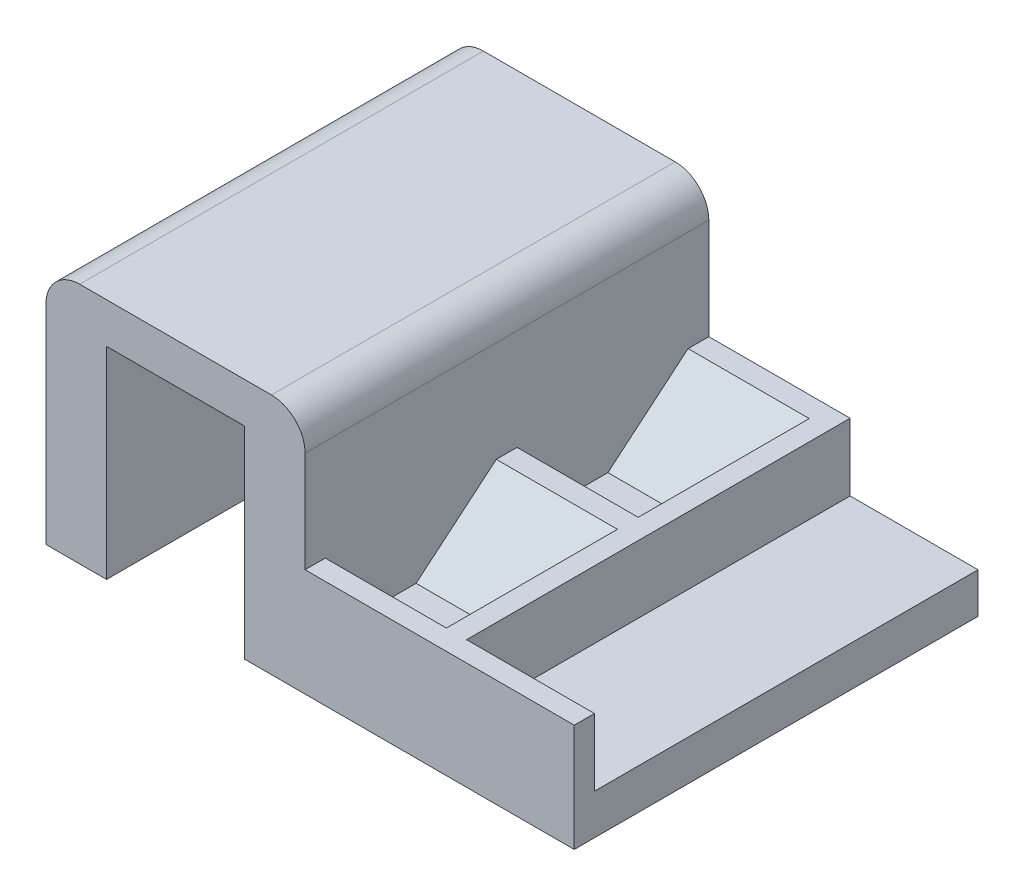
ISO-10303-21;
HEADER;
FILE_DESCRIPTION(('STEP AP214'),'2;1');
FILE_NAME('part.step','',(''),(''),'','','');
FILE_SCHEMA(('AUTOMOTIVE_DESIGN { 1 0 10303 214 1 1 1 1 }'));
ENDSEC;
DATA;
#1=APPLICATION_CONTEXT('core data for automotive mechanical design processes');
#2=APPLICATION_PROTOCOL_DEFINITION('international standard','automotive_design',2000,#1);
#3=PRODUCT_CONTEXT('',#1,'mechanical');
#4=PRODUCT('Part','Part','',(#3));
#5=PRODUCT_RELATED_PRODUCT_CATEGORY('part','',(#4));
#6=PRODUCT_DEFINITION_FORMATION('','',#4);
#7=PRODUCT_DEFINITION_CONTEXT('part definition',#1,'design');
#8=PRODUCT_DEFINITION('design','',#6,#7);
#9=PRODUCT_DEFINITION_SHAPE('','',#8);
#10=(LENGTH_UNIT() NAMED_UNIT(*) SI_UNIT(.MILLI.,.METRE.));
#11=(NAMED_UNIT(*) PLANE_ANGLE_UNIT() SI_UNIT($,.RADIAN.));
#12=(NAMED_UNIT(*) SI_UNIT($,.STERADIAN.) SOLID_ANGLE_UNIT());
#13=UNCERTAINTY_MEASURE_WITH_UNIT(LENGTH_MEASURE(1.E-05),#10,'distance_accuracy_value','');
#14=(GEOMETRIC_REPRESENTATION_CONTEXT(3) GLOBAL_UNCERTAINTY_ASSIGNED_CONTEXT((#13)) GLOBAL_UNIT_ASSIGNED_CONTEXT((#10,
#11,#12)) REPRESENTATION_CONTEXT('',''));
#15=CARTESIAN_POINT('',(0.,0.,0.));
#16=DIRECTION('',(0.,0.,1.));
#17=DIRECTION('',(1.,0.,0.));
#18=AXIS2_PLACEMENT_3D('',#15,#16,#17);
#19=CARTESIAN_POINT('',(69.5,6.,60.));
#20=DIRECTION('',(0.,-1.,0.));
#21=DIRECTION('',(1.,0.,0.));
#22=AXIS2_PLACEMENT_3D('',#19,#20,#21);
#23=PLANE('',#22);
#24=DIRECTION('',(0.,0.,1.));
#25=VECTOR('',#24,1.);
#26=CARTESIAN_POINT('',(47.5,6.,0.));
#27=LINE('',#26,#25);
#28=CARTESIAN_POINT('',(47.5,6.,15.0000000000001));
#29=VERTEX_POINT('',#28);
#30=CARTESIAN_POINT('',(47.5,6.,28.5));
#31=VERTEX_POINT('',#30);
#32=EDGE_CURVE('E209',#29,#31,#27,.T.);
#33=ORIENTED_EDGE('',*,*,#32,.F.);
#34=DIRECTION('',(-1.,0.,0.));
#35=VECTOR('',#34,1.);
#36=CARTESIAN_POINT('',(29.5,5.99999999999999,15.0000000000001));
#37=LINE('',#36,#35);
#38=CARTESIAN_POINT('',(29.5,5.99999999999999,15.0000000000001));
#39=VERTEX_POINT('',#38);
#40=EDGE_CURVE('E347',#29,#39,#37,.T.);
#41=ORIENTED_EDGE('',*,*,#40,.T.);
#42=DIRECTION('',(0.,0.,-1.));
#43=VECTOR('',#42,1.);
#44=CARTESIAN_POINT('',(29.5,5.99999999999999,60.));
#45=LINE('',#44,#43);
#46=CARTESIAN_POINT('',(29.5,5.99999999999999,28.5));
#47=VERTEX_POINT('',#46);
#48=EDGE_CURVE('E313',#47,#39,#45,.T.);
#49=ORIENTED_EDGE('',*,*,#48,.F.);
#50=DIRECTION('',(1.,0.,0.));
#51=VECTOR('',#50,1.);
#52=CARTESIAN_POINT('',(0.,5.99999999999999,28.5));
#53=LINE('',#52,#51);
#54=EDGE_CURVE('E243',#47,#31,#53,.T.);
#55=ORIENTED_EDGE('',*,*,#54,.T.);
#56=EDGE_LOOP('',(#33,#41,#49,#55));
#57=FACE_BOUND('',#56,.T.);
#58=ADVANCED_FACE('F36',(#57),#23,.F.);
#59=DIRECTION('',(-1.,0.,0.));
#60=VECTOR('',#59,1.);
#61=CARTESIAN_POINT('',(0.,5.99999999999999,57.));
#62=LINE('',#61,#60);
#63=CARTESIAN_POINT('',(69.5,6.,57.));
#64=VERTEX_POINT('',#63);
#65=CARTESIAN_POINT('',(50.5,6.,57.));
#66=VERTEX_POINT('',#65);
#67=EDGE_CURVE('E249',#64,#66,#62,.T.);
#68=ORIENTED_EDGE('',*,*,#67,.F.);
#69=DIRECTION('',(0.,0.,-1.));
#70=VECTOR('',#69,1.);
#71=CARTESIAN_POINT('',(69.5,6.,60.));
#72=LINE('',#71,#70);
#73=CARTESIAN_POINT('',(69.5,6.,0.));
#74=VERTEX_POINT('',#73);
#75=EDGE_CURVE('E317',#64,#74,#72,.T.);
#76=ORIENTED_EDGE('',*,*,#75,.T.);
#77=DIRECTION('',(-1.,0.,0.));
#78=VECTOR('',#77,1.);
#79=CARTESIAN_POINT('',(69.5,6.,0.));
#80=LINE('',#79,#78);
#81=CARTESIAN_POINT('',(50.5,6.,0.));
#82=VERTEX_POINT('',#81);
#83=EDGE_CURVE('E303',#74,#82,#80,.T.);
#84=ORIENTED_EDGE('',*,*,#83,.T.);
#85=DIRECTION('',(0.,0.,-1.));
#86=VECTOR('',#85,1.);
#87=CARTESIAN_POINT('',(50.5,6.,0.));
#88=LINE('',#87,#86);
#89=EDGE_CURVE('E252',#66,#82,#88,.T.);
#90=ORIENTED_EDGE('',*,*,#89,.F.);
#91=EDGE_LOOP('',(#68,#76,#84,#90));
#92=FACE_BOUND('',#91,.T.);
#93=ADVANCED_FACE('F387',(#92),#23,.F.);
#94=CARTESIAN_POINT('',(29.5,5.99999999999999,60.));
#95=DIRECTION('',(-1.,0.,0.));
#96=DIRECTION('',(0.,-1.,0.));
#97=AXIS2_PLACEMENT_3D('',#94,#95,#96);
#98=PLANE('',#97);
#99=DIRECTION('',(0.,1.,0.));
#100=VECTOR('',#99,1.);
#101=CARTESIAN_POINT('',(29.5,5.99999999999999,0.));
#102=LINE('',#101,#100);
#103=CARTESIAN_POINT('',(29.5,16.,0.));
#104=VERTEX_POINT('',#103);
#105=CARTESIAN_POINT('',(29.5,31.,0.));
#106=VERTEX_POINT('',#105);
#107=EDGE_CURVE('E305',#104,#106,#102,.T.);
#108=ORIENTED_EDGE('',*,*,#107,.T.);
#109=DIRECTION('',(0.,0.,-1.));
#110=VECTOR('',#109,1.);
#111=CARTESIAN_POINT('',(29.5,31.,60.));
#112=LINE('',#111,#110);
#113=CARTESIAN_POINT('',(29.5,31.,60.));
#114=VERTEX_POINT('',#113);
#115=EDGE_CURVE('E59',#106,#114,#112,.F.);
#116=ORIENTED_EDGE('',*,*,#115,.T.);
#117=DIRECTION('',(0.,1.,0.));
#118=VECTOR('',#117,1.);
#119=CARTESIAN_POINT('',(29.5,5.99999999999999,60.));
#120=LINE('',#119,#118);
#121=CARTESIAN_POINT('',(29.5,16.,60.));
#122=VERTEX_POINT('',#121);
#123=EDGE_CURVE('E283',#122,#114,#120,.T.);
#124=ORIENTED_EDGE('',*,*,#123,.F.);
#125=DIRECTION('',(0.,0.,1.));
#126=VECTOR('',#125,1.);
#127=CARTESIAN_POINT('',(29.5,16.,0.));
#128=LINE('',#127,#126);
#129=CARTESIAN_POINT('',(29.5,16.,57.));
#130=VERTEX_POINT('',#129);
#131=EDGE_CURVE('E226',#130,#122,#128,.T.);
#132=ORIENTED_EDGE('',*,*,#131,.F.);
#133=DIRECTION('',(0.,-1.,0.));
#134=VECTOR('',#133,1.);
#135=CARTESIAN_POINT('',(29.5,16.,57.));
#136=LINE('',#135,#134);
#137=CARTESIAN_POINT('',(29.5,5.99999999999999,57.));
#138=VERTEX_POINT('',#137);
#139=EDGE_CURVE('E263',#130,#138,#136,.T.);
#140=ORIENTED_EDGE('',*,*,#139,.T.);
#141=CARTESIAN_POINT('',(29.5,5.99999999999999,43.5000000000001));
#142=VERTEX_POINT('',#141);
#143=EDGE_CURVE('E316',#138,#142,#45,.T.);
#144=ORIENTED_EDGE('',*,*,#143,.T.);
#145=DIRECTION('',(0.,0.642787609686544,-0.766044443118974));
#146=VECTOR('',#145,1.);
#147=CARTESIAN_POINT('',(29.5,6.00000000000001,43.5000000000001));
#148=LINE('',#147,#146);
#149=CARTESIAN_POINT('',(29.5,16.,31.5824640740581));
#150=VERTEX_POINT('',#149);
#151=EDGE_CURVE('E340',#142,#150,#148,.T.);
#152=ORIENTED_EDGE('',*,*,#151,.T.);
#153=DIRECTION('',(0.,0.,1.));
#154=VECTOR('',#153,1.);
#155=CARTESIAN_POINT('',(29.5,16.,0.));
#156=LINE('',#155,#154);
#157=CARTESIAN_POINT('',(29.5,16.,28.5));
#158=VERTEX_POINT('',#157);
#159=EDGE_CURVE('E218',#158,#150,#156,.T.);
#160=ORIENTED_EDGE('',*,*,#159,.F.);
#161=DIRECTION('',(0.,-1.,0.));
#162=VECTOR('',#161,1.);
#163=CARTESIAN_POINT('',(29.5,16.,28.5));
#164=LINE('',#163,#162);
#165=EDGE_CURVE('E214',#158,#47,#164,.T.);
#166=ORIENTED_EDGE('',*,*,#165,.T.);
#167=ORIENTED_EDGE('',*,*,#48,.T.);
#168=DIRECTION('',(0.,-0.642787609686544,0.766044443118974));
#169=VECTOR('',#168,1.);
#170=CARTESIAN_POINT('',(29.5,16.0691955741275,3.00000000000001));
#171=LINE('',#170,#169);
#172=CARTESIAN_POINT('',(29.5,16.,3.08246407405811));
#173=VERTEX_POINT('',#172);
#174=EDGE_CURVE('E337',#39,#173,#171,.F.);
#175=ORIENTED_EDGE('',*,*,#174,.T.);
#176=DIRECTION('',(0.,0.,1.));
#177=VECTOR('',#176,1.);
#178=CARTESIAN_POINT('',(29.5,16.,0.));
#179=LINE('',#178,#177);
#180=EDGE_CURVE('E202',#104,#173,#179,.T.);
#181=ORIENTED_EDGE('',*,*,#180,.F.);
#182=EDGE_LOOP('',(#108,#116,#124,#132,#140,#144,#152,#160,#166,#167,#175,#181));
#183=FACE_BOUND('',#182,.T.);
#184=ADVANCED_FACE('F378',(#183),#98,.F.);
#185=CARTESIAN_POINT('',(-9.,0.,60.));
#186=DIRECTION('',(0.,1.,0.));
#187=DIRECTION('',(0.,0.,1.));
#188=AXIS2_PLACEMENT_3D('',#185,#186,#187);
#189=PLANE('',#188);
#190=DIRECTION('',(1.,0.,0.));
#191=VECTOR('',#190,1.);
#192=CARTESIAN_POINT('',(-9.,0.,0.));
#193=LINE('',#192,#191);
#194=CARTESIAN_POINT('',(-9.,0.,0.));
#195=VERTEX_POINT('',#194);
#196=CARTESIAN_POINT('',(0.,0.,0.));
#197=VERTEX_POINT('',#196);
#198=EDGE_CURVE('E213',#195,#197,#193,.T.);
#199=ORIENTED_EDGE('',*,*,#198,.T.);
#200=DIRECTION('',(0.,0.,-1.));
#201=VECTOR('',#200,1.);
#202=CARTESIAN_POINT('',(0.,0.,60.));
#203=LINE('',#202,#201);
#204=CARTESIAN_POINT('',(0.,0.,60.));
#205=VERTEX_POINT('',#204);
#206=EDGE_CURVE('E331',#205,#197,#203,.T.);
#207=ORIENTED_EDGE('',*,*,#206,.F.);
#208=DIRECTION('',(1.,0.,0.));
#209=VECTOR('',#208,1.);
#210=CARTESIAN_POINT('',(-9.,0.,60.));
#211=LINE('',#210,#209);
#212=CARTESIAN_POINT('',(-9.,0.,60.));
#213=VERTEX_POINT('',#212);
#214=EDGE_CURVE('E269',#213,#205,#211,.T.);
#215=ORIENTED_EDGE('',*,*,#214,.F.);
#216=DIRECTION('',(0.,0.,-1.));
#217=VECTOR('',#216,1.);
#218=CARTESIAN_POINT('',(-9.,0.,60.));
#219=LINE('',#218,#217);
#220=EDGE_CURVE('E289',#213,#195,#219,.T.);
#221=ORIENTED_EDGE('',*,*,#220,.T.);
#222=EDGE_LOOP('',(#199,#207,#215,#221));
#223=FACE_BOUND('',#222,.T.);
#224=ADVANCED_FACE('F420',(#223),#189,.F.);
#225=CARTESIAN_POINT('',(0.,0.,60.));
#226=DIRECTION('',(-1.,0.,0.));
#227=DIRECTION('',(0.,0.,1.));
#228=AXIS2_PLACEMENT_3D('',#225,#226,#227);
#229=PLANE('',#228);
#230=DIRECTION('',(0.,1.,0.));
#231=VECTOR('',#230,1.);
#232=CARTESIAN_POINT('',(0.,0.,0.));
#233=LINE('',#232,#231);
#234=CARTESIAN_POINT('',(0.,30.,0.));
#235=VERTEX_POINT('',#234);
#236=EDGE_CURVE('E292',#197,#235,#233,.T.);
#237=ORIENTED_EDGE('',*,*,#236,.T.);
#238=DIRECTION('',(0.,0.,-1.));
#239=VECTOR('',#238,1.);
#240=CARTESIAN_POINT('',(0.,30.,60.));
#241=LINE('',#240,#239);
#242=CARTESIAN_POINT('',(0.,30.,60.));
#243=VERTEX_POINT('',#242);
#244=EDGE_CURVE('E328',#243,#235,#241,.T.);
#245=ORIENTED_EDGE('',*,*,#244,.F.);
#246=DIRECTION('',(0.,1.,0.));
#247=VECTOR('',#246,1.);
#248=CARTESIAN_POINT('',(0.,0.,60.));
#249=LINE('',#248,#247);
#250=EDGE_CURVE('E272',#205,#243,#249,.T.);
#251=ORIENTED_EDGE('',*,*,#250,.F.);
#252=ORIENTED_EDGE('',*,*,#206,.T.);
#253=EDGE_LOOP('',(#237,#245,#251,#252));
#254=FACE_BOUND('',#253,.T.);
#255=ADVANCED_FACE('F417',(#254),#229,.F.);
#256=CARTESIAN_POINT('',(0.,30.,60.));
#257=DIRECTION('',(0.,1.,0.));
#258=DIRECTION('',(0.,0.,1.));
#259=AXIS2_PLACEMENT_3D('',#256,#257,#258);
#260=PLANE('',#259);
#261=DIRECTION('',(1.,0.,0.));
#262=VECTOR('',#261,1.);
#263=CARTESIAN_POINT('',(0.,30.,0.));
#264=LINE('',#263,#262);
#265=CARTESIAN_POINT('',(20.5,30.,0.));
#266=VERTEX_POINT('',#265);
#267=EDGE_CURVE('E294',#235,#266,#264,.T.);
#268=ORIENTED_EDGE('',*,*,#267,.T.);
#269=DIRECTION('',(0.,0.,-1.));
#270=VECTOR('',#269,1.);
#271=CARTESIAN_POINT('',(20.5,30.,60.));
#272=LINE('',#271,#270);
#273=CARTESIAN_POINT('',(20.5,30.,60.));
#274=VERTEX_POINT('',#273);
#275=EDGE_CURVE('E325',#274,#266,#272,.T.);
#276=ORIENTED_EDGE('',*,*,#275,.F.);
#277=DIRECTION('',(1.,0.,0.));
#278=VECTOR('',#277,1.);
#279=CARTESIAN_POINT('',(0.,30.,60.));
#280=LINE('',#279,#278);
#281=EDGE_CURVE('E275',#243,#274,#280,.T.);
#282=ORIENTED_EDGE('',*,*,#281,.F.);
#283=ORIENTED_EDGE('',*,*,#244,.T.);
#284=EDGE_LOOP('',(#268,#276,#282,#283));
#285=FACE_BOUND('',#284,.T.);
#286=ADVANCED_FACE('F411',(#285),#260,.F.);
#287=CARTESIAN_POINT('',(20.5,30.,60.));
#288=DIRECTION('',(1.,0.,0.));
#289=DIRECTION('',(0.,0.,-1.));
#290=AXIS2_PLACEMENT_3D('',#287,#288,#289);
#291=PLANE('',#290);
#292=DIRECTION('',(0.,-1.,0.));
#293=VECTOR('',#292,1.);
#294=CARTESIAN_POINT('',(20.5,30.,0.));
#295=LINE('',#294,#293);
#296=CARTESIAN_POINT('',(20.5,0.,0.));
#297=VERTEX_POINT('',#296);
#298=EDGE_CURVE('E296',#266,#297,#295,.T.);
#299=ORIENTED_EDGE('',*,*,#298,.T.);
#300=DIRECTION('',(0.,0.,-1.));
#301=VECTOR('',#300,1.);
#302=CARTESIAN_POINT('',(20.5,0.,60.));
#303=LINE('',#302,#301);
#304=CARTESIAN_POINT('',(20.5,0.,60.));
#305=VERTEX_POINT('',#304);
#306=EDGE_CURVE('E322',#305,#297,#303,.T.);
#307=ORIENTED_EDGE('',*,*,#306,.F.);
#308=DIRECTION('',(0.,-1.,0.));
#309=VECTOR('',#308,1.);
#310=CARTESIAN_POINT('',(20.5,30.,60.));
#311=LINE('',#310,#309);
#312=EDGE_CURVE('E277',#274,#305,#311,.T.);
#313=ORIENTED_EDGE('',*,*,#312,.F.);
#314=ORIENTED_EDGE('',*,*,#275,.T.);
#315=EDGE_LOOP('',(#299,#307,#313,#314));
#316=FACE_BOUND('',#315,.T.);
#317=ADVANCED_FACE('F407',(#316),#291,.F.);
#318=CARTESIAN_POINT('',(20.5,0.,60.));
#319=DIRECTION('',(0.,1.,0.));
#320=DIRECTION('',(0.,0.,1.));
#321=AXIS2_PLACEMENT_3D('',#318,#319,#320);
#322=PLANE('',#321);
#323=DIRECTION('',(1.,0.,0.));
#324=VECTOR('',#323,1.);
#325=CARTESIAN_POINT('',(20.5,0.,0.));
#326=LINE('',#325,#324);
#327=CARTESIAN_POINT('',(69.5,0.,0.));
#328=VERTEX_POINT('',#327);
#329=EDGE_CURVE('E298',#297,#328,#326,.T.);
#330=ORIENTED_EDGE('',*,*,#329,.T.);
#331=DIRECTION('',(0.,0.,-1.));
#332=VECTOR('',#331,1.);
#333=CARTESIAN_POINT('',(69.5,0.,60.));
#334=LINE('',#333,#332);
#335=CARTESIAN_POINT('',(69.5,0.,60.));
#336=VERTEX_POINT('',#335);
#337=EDGE_CURVE('E319',#336,#328,#334,.T.);
#338=ORIENTED_EDGE('',*,*,#337,.F.);
#339=DIRECTION('',(1.,0.,0.));
#340=VECTOR('',#339,1.);
#341=CARTESIAN_POINT('',(20.5,0.,60.));
#342=LINE('',#341,#340);
#343=EDGE_CURVE('E279',#305,#336,#342,.T.);
#344=ORIENTED_EDGE('',*,*,#343,.F.);
#345=ORIENTED_EDGE('',*,*,#306,.T.);
#346=EDGE_LOOP('',(#330,#338,#344,#345));
#347=FACE_BOUND('',#346,.T.);
#348=ADVANCED_FACE('F402',(#347),#322,.F.);
#349=CARTESIAN_POINT('',(69.5,0.,60.));
#350=DIRECTION('',(-1.,0.,0.));
#351=DIRECTION('',(0.,0.,1.));
#352=AXIS2_PLACEMENT_3D('',#349,#350,#351);
#353=PLANE('',#352);
#354=DIRECTION('',(0.,1.,0.));
#355=VECTOR('',#354,1.);
#356=CARTESIAN_POINT('',(69.5,0.,0.));
#357=LINE('',#356,#355);
#358=EDGE_CURVE('E300',#328,#74,#357,.T.);
#359=ORIENTED_EDGE('',*,*,#358,.T.);
#360=ORIENTED_EDGE('',*,*,#75,.F.);
#361=DIRECTION('',(0.,-1.,0.));
#362=VECTOR('',#361,1.);
#363=CARTESIAN_POINT('',(69.5,16.,57.));
#364=LINE('',#363,#362);
#365=CARTESIAN_POINT('',(69.5,16.,57.));
#366=VERTEX_POINT('',#365);
#367=EDGE_CURVE('E260',#366,#64,#364,.T.);
#368=ORIENTED_EDGE('',*,*,#367,.F.);
#369=DIRECTION('',(0.,0.,-1.));
#370=VECTOR('',#369,1.);
#371=CARTESIAN_POINT('',(69.5,16.,0.));
#372=LINE('',#371,#370);
#373=CARTESIAN_POINT('',(69.5,16.,60.));
#374=VERTEX_POINT('',#373);
#375=EDGE_CURVE('E232',#374,#366,#372,.T.);
#376=ORIENTED_EDGE('',*,*,#375,.F.);
#377=DIRECTION('',(0.,1.,0.));
#378=VECTOR('',#377,1.);
#379=CARTESIAN_POINT('',(69.5,0.,60.));
#380=LINE('',#379,#378);
#381=EDGE_CURVE('E281',#336,#374,#380,.T.);
#382=ORIENTED_EDGE('',*,*,#381,.F.);
#383=ORIENTED_EDGE('',*,*,#337,.T.);
#384=EDGE_LOOP('',(#359,#360,#368,#376,#382,#383));
#385=FACE_BOUND('',#384,.T.);
#386=ADVANCED_FACE('F395',(#385),#353,.F.);
#387=CARTESIAN_POINT('',(47.5,6.,43.5000000000001));
#388=VERTEX_POINT('',#387);
#389=CARTESIAN_POINT('',(47.5,6.,57.));
#390=VERTEX_POINT('',#389);
#391=EDGE_CURVE('E244',#388,#390,#27,.T.);
#392=ORIENTED_EDGE('',*,*,#391,.F.);
#393=DIRECTION('',(-1.,0.,0.));
#394=VECTOR('',#393,1.);
#395=CARTESIAN_POINT('',(69.5,6.,43.5000000000001));
#396=LINE('',#395,#394);
#397=EDGE_CURVE('E334',#388,#142,#396,.T.);
#398=ORIENTED_EDGE('',*,*,#397,.T.);
#399=ORIENTED_EDGE('',*,*,#143,.F.);
#400=DIRECTION('',(1.,0.,0.));
#401=VECTOR('',#400,1.);
#402=CARTESIAN_POINT('',(0.,5.99999999999999,57.));
#403=LINE('',#402,#401);
#404=EDGE_CURVE('E246',#138,#390,#403,.T.);
#405=ORIENTED_EDGE('',*,*,#404,.T.);
#406=EDGE_LOOP('',(#392,#398,#399,#405));
#407=FACE_BOUND('',#406,.T.);
#408=ADVANCED_FACE('F434',(#407),#23,.F.);
#409=CARTESIAN_POINT('',(29.5,36.,60.));
#410=DIRECTION('',(0.,-1.,0.));
#411=DIRECTION('',(1.,0.,0.));
#412=AXIS2_PLACEMENT_3D('',#409,#410,#411);
#413=PLANE('',#412);
#414=DIRECTION('',(-1.,0.,0.));
#415=VECTOR('',#414,1.);
#416=CARTESIAN_POINT('',(29.5,36.,60.));
#417=LINE('',#416,#415);
#418=CARTESIAN_POINT('',(24.5,36.,60.));
#419=VERTEX_POINT('',#418);
#420=CARTESIAN_POINT('',(-4.00000000000001,36.,60.));
#421=VERTEX_POINT('',#420);
#422=EDGE_CURVE('E285',#419,#421,#417,.T.);
#423=ORIENTED_EDGE('',*,*,#422,.F.);
#424=DIRECTION('',(0.,0.,-1.));
#425=VECTOR('',#424,1.);
#426=CARTESIAN_POINT('',(24.5,36.,60.));
#427=LINE('',#426,#425);
#428=CARTESIAN_POINT('',(24.5,36.,0.));
#429=VERTEX_POINT('',#428);
#430=EDGE_CURVE('E355',#419,#429,#427,.T.);
#431=ORIENTED_EDGE('',*,*,#430,.T.);
#432=DIRECTION('',(-1.,0.,0.));
#433=VECTOR('',#432,1.);
#434=CARTESIAN_POINT('',(29.5,36.,0.));
#435=LINE('',#434,#433);
#436=CARTESIAN_POINT('',(-4.00000000000001,36.,0.));
#437=VERTEX_POINT('',#436);
#438=EDGE_CURVE('E307',#429,#437,#435,.T.);
#439=ORIENTED_EDGE('',*,*,#438,.T.);
#440=DIRECTION('',(0.,0.,-1.));
#441=VECTOR('',#440,1.);
#442=CARTESIAN_POINT('',(-4.00000000000001,36.,60.));
#443=LINE('',#442,#441);
#444=EDGE_CURVE('E353',#437,#421,#443,.F.);
#445=ORIENTED_EDGE('',*,*,#444,.T.);
#446=EDGE_LOOP('',(#423,#431,#439,#445));
#447=FACE_BOUND('',#446,.T.);
#448=ADVANCED_FACE('F370',(#447),#413,.F.);
#449=CARTESIAN_POINT('',(-9.00000000000001,36.,60.));
#450=DIRECTION('',(1.,0.,0.));
#451=DIRECTION('',(0.,1.,0.));
#452=AXIS2_PLACEMENT_3D('',#449,#450,#451);
#453=PLANE('',#452);
#454=DIRECTION('',(0.,-1.,0.));
#455=VECTOR('',#454,1.);
#456=CARTESIAN_POINT('',(-9.00000000000001,36.,60.));
#457=LINE('',#456,#455);
#458=CARTESIAN_POINT('',(-9.00000000000001,31.,60.));
#459=VERTEX_POINT('',#458);
#460=EDGE_CURVE('E287',#459,#213,#457,.T.);
#461=ORIENTED_EDGE('',*,*,#460,.F.);
#462=DIRECTION('',(0.,0.,-1.));
#463=VECTOR('',#462,1.);
#464=CARTESIAN_POINT('',(-9.00000000000001,31.,60.));
#465=LINE('',#464,#463);
#466=CARTESIAN_POINT('',(-9.00000000000001,31.,0.));
#467=VERTEX_POINT('',#466);
#468=EDGE_CURVE('E11',#459,#467,#465,.T.);
#469=ORIENTED_EDGE('',*,*,#468,.T.);
#470=DIRECTION('',(0.,-1.,0.));
#471=VECTOR('',#470,1.);
#472=CARTESIAN_POINT('',(-9.00000000000001,36.,0.));
#473=LINE('',#472,#471);
#474=EDGE_CURVE('E273',#467,#195,#473,.T.);
#475=ORIENTED_EDGE('',*,*,#474,.T.);
#476=ORIENTED_EDGE('',*,*,#220,.F.);
#477=EDGE_LOOP('',(#461,#469,#475,#476));
#478=FACE_BOUND('',#477,.T.);
#479=ADVANCED_FACE('F423',(#478),#453,.F.);
#480=CARTESIAN_POINT('',(0.,0.,60.));
#481=DIRECTION('',(0.,0.,1.));
#482=DIRECTION('',(1.,0.,0.));
#483=AXIS2_PLACEMENT_3D('',#480,#481,#482);
#484=PLANE('',#483);
#485=ORIENTED_EDGE('',*,*,#123,.T.);
#486=CARTESIAN_POINT('',(24.5,31.,60.));
#487=DIRECTION('',(0.,0.,1.));
#488=DIRECTION('',(1.,0.,0.));
#489=AXIS2_PLACEMENT_3D('',#486,#487,#488);
#490=CIRCLE('',#489,5.);
#491=EDGE_CURVE('E44',#114,#419,#490,.T.);
#492=ORIENTED_EDGE('',*,*,#491,.T.);
#493=ORIENTED_EDGE('',*,*,#422,.T.);
#494=CARTESIAN_POINT('',(-4.,31.,60.));
#495=DIRECTION('',(0.,0.,1.));
#496=DIRECTION('',(1.,0.,0.));
#497=AXIS2_PLACEMENT_3D('',#494,#495,#496);
#498=CIRCLE('',#497,5.);
#499=EDGE_CURVE('E51',#421,#459,#498,.T.);
#500=ORIENTED_EDGE('',*,*,#499,.T.);
#501=ORIENTED_EDGE('',*,*,#460,.T.);
#502=ORIENTED_EDGE('',*,*,#214,.T.);
#503=ORIENTED_EDGE('',*,*,#250,.T.);
#504=ORIENTED_EDGE('',*,*,#281,.T.);
#505=ORIENTED_EDGE('',*,*,#312,.T.);
#506=ORIENTED_EDGE('',*,*,#343,.T.);
#507=ORIENTED_EDGE('',*,*,#381,.T.);
#508=DIRECTION('',(1.,0.,0.));
#509=VECTOR('',#508,1.);
#510=CARTESIAN_POINT('',(0.,16.,60.));
#511=LINE('',#510,#509);
#512=EDGE_CURVE('E229',#122,#374,#511,.T.);
#513=ORIENTED_EDGE('',*,*,#512,.F.);
#514=EDGE_LOOP('',(#485,#492,#493,#500,#501,#502,#503,#504,#505,#506,#507,#513));
#515=FACE_BOUND('',#514,.T.);
#516=ADVANCED_FACE('F365',(#515),#484,.T.);
#517=CARTESIAN_POINT('',(0.,0.,0.));
#518=DIRECTION('',(0.,0.,1.));
#519=DIRECTION('',(1.,0.,0.));
#520=AXIS2_PLACEMENT_3D('',#517,#518,#519);
#521=PLANE('',#520);
#522=ORIENTED_EDGE('',*,*,#438,.F.);
#523=CARTESIAN_POINT('',(24.5,31.,0.));
#524=DIRECTION('',(0.,0.,1.));
#525=DIRECTION('',(1.,0.,0.));
#526=AXIS2_PLACEMENT_3D('',#523,#524,#525);
#527=CIRCLE('',#526,5.);
#528=EDGE_CURVE('E360',#429,#106,#527,.F.);
#529=ORIENTED_EDGE('',*,*,#528,.T.);
#530=ORIENTED_EDGE('',*,*,#107,.F.);
#531=DIRECTION('',(-1.,0.,0.));
#532=VECTOR('',#531,1.);
#533=CARTESIAN_POINT('',(0.,16.,0.));
#534=LINE('',#533,#532);
#535=CARTESIAN_POINT('',(50.5,16.,0.));
#536=VERTEX_POINT('',#535);
#537=EDGE_CURVE('E238',#536,#104,#534,.T.);
#538=ORIENTED_EDGE('',*,*,#537,.F.);
#539=DIRECTION('',(0.,-1.,0.));
#540=VECTOR('',#539,1.);
#541=CARTESIAN_POINT('',(50.5,16.,0.));
#542=LINE('',#541,#540);
#543=EDGE_CURVE('E241',#536,#82,#542,.T.);
#544=ORIENTED_EDGE('',*,*,#543,.T.);
#545=ORIENTED_EDGE('',*,*,#83,.F.);
#546=ORIENTED_EDGE('',*,*,#358,.F.);
#547=ORIENTED_EDGE('',*,*,#329,.F.);
#548=ORIENTED_EDGE('',*,*,#298,.F.);
#549=ORIENTED_EDGE('',*,*,#267,.F.);
#550=ORIENTED_EDGE('',*,*,#236,.F.);
#551=ORIENTED_EDGE('',*,*,#198,.F.);
#552=ORIENTED_EDGE('',*,*,#474,.F.);
#553=CARTESIAN_POINT('',(-4.,31.,0.));
#554=DIRECTION('',(0.,0.,1.));
#555=DIRECTION('',(1.,0.,0.));
#556=AXIS2_PLACEMENT_3D('',#553,#554,#555);
#557=CIRCLE('',#556,5.);
#558=EDGE_CURVE('E358',#467,#437,#557,.F.);
#559=ORIENTED_EDGE('',*,*,#558,.T.);
#560=EDGE_LOOP('',(#522,#529,#530,#538,#544,#545,#546,#547,#548,#549,#550,#551,#552,#559));
#561=FACE_BOUND('',#560,.T.);
#562=ADVANCED_FACE('F376',(#561),#521,.F.);
#563=CARTESIAN_POINT('',(47.5,16.,0.));
#564=DIRECTION('',(1.,0.,0.));
#565=DIRECTION('',(0.,0.,-1.));
#566=AXIS2_PLACEMENT_3D('',#563,#564,#565);
#567=PLANE('',#566);
#568=DIRECTION('',(0.,0.,1.));
#569=VECTOR('',#568,1.);
#570=CARTESIAN_POINT('',(47.5,16.,0.));
#571=LINE('',#570,#569);
#572=CARTESIAN_POINT('',(47.5,16.,3.0824640740581));
#573=VERTEX_POINT('',#572);
#574=CARTESIAN_POINT('',(47.5,16.,28.5));
#575=VERTEX_POINT('',#574);
#576=EDGE_CURVE('E193',#573,#575,#571,.T.);
#577=ORIENTED_EDGE('',*,*,#576,.F.);
#578=DIRECTION('',(0.,0.642787609686544,-0.766044443118974));
#579=VECTOR('',#578,1.);
#580=CARTESIAN_POINT('',(47.5,16.0691955741275,3.));
#581=LINE('',#580,#579);
#582=EDGE_CURVE('E345',#573,#29,#581,.F.);
#583=ORIENTED_EDGE('',*,*,#582,.T.);
#584=ORIENTED_EDGE('',*,*,#32,.T.);
#585=DIRECTION('',(0.,-1.,0.));
#586=VECTOR('',#585,1.);
#587=CARTESIAN_POINT('',(47.5,16.,28.5));
#588=LINE('',#587,#586);
#589=EDGE_CURVE('E206',#575,#31,#588,.T.);
#590=ORIENTED_EDGE('',*,*,#589,.F.);
#591=EDGE_LOOP('',(#577,#583,#584,#590));
#592=FACE_BOUND('',#591,.T.);
#593=ADVANCED_FACE('F207',(#592),#567,.F.);
#594=CARTESIAN_POINT('',(0.,16.,28.5));
#595=DIRECTION('',(0.,0.,-1.));
#596=DIRECTION('',(-1.,0.,0.));
#597=AXIS2_PLACEMENT_3D('',#594,#595,#596);
#598=PLANE('',#597);
#599=ORIENTED_EDGE('',*,*,#54,.F.);
#600=ORIENTED_EDGE('',*,*,#165,.F.);
#601=DIRECTION('',(1.,0.,0.));
#602=VECTOR('',#601,1.);
#603=CARTESIAN_POINT('',(0.,16.,28.5));
#604=LINE('',#603,#602);
#605=EDGE_CURVE('E197',#158,#575,#604,.T.);
#606=ORIENTED_EDGE('',*,*,#605,.T.);
#607=ORIENTED_EDGE('',*,*,#589,.T.);
#608=EDGE_LOOP('',(#599,#600,#606,#607));
#609=FACE_BOUND('',#608,.T.);
#610=ADVANCED_FACE('F217',(#609),#598,.T.);
#611=CARTESIAN_POINT('',(47.5,16.,31.5824640740581));
#612=VERTEX_POINT('',#611);
#613=CARTESIAN_POINT('',(47.5,16.,57.));
#614=VERTEX_POINT('',#613);
#615=EDGE_CURVE('E204',#612,#614,#571,.T.);
#616=ORIENTED_EDGE('',*,*,#615,.F.);
#617=DIRECTION('',(0.,-0.642787609686544,0.766044443118974));
#618=VECTOR('',#617,1.);
#619=CARTESIAN_POINT('',(47.5,6.,43.5000000000001));
#620=LINE('',#619,#618);
#621=EDGE_CURVE('E343',#612,#388,#620,.T.);
#622=ORIENTED_EDGE('',*,*,#621,.T.);
#623=ORIENTED_EDGE('',*,*,#391,.T.);
#624=DIRECTION('',(0.,-1.,0.));
#625=VECTOR('',#624,1.);
#626=CARTESIAN_POINT('',(47.5,16.,57.));
#627=LINE('',#626,#625);
#628=EDGE_CURVE('E265',#614,#390,#627,.T.);
#629=ORIENTED_EDGE('',*,*,#628,.F.);
#630=EDGE_LOOP('',(#616,#622,#623,#629));
#631=FACE_BOUND('',#630,.T.);
#632=ADVANCED_FACE('F463',(#631),#567,.F.);
#633=CARTESIAN_POINT('',(0.,16.,57.));
#634=DIRECTION('',(0.,0.,-1.));
#635=DIRECTION('',(-1.,0.,0.));
#636=AXIS2_PLACEMENT_3D('',#633,#634,#635);
#637=PLANE('',#636);
#638=ORIENTED_EDGE('',*,*,#404,.F.);
#639=ORIENTED_EDGE('',*,*,#139,.F.);
#640=DIRECTION('',(1.,0.,0.));
#641=VECTOR('',#640,1.);
#642=CARTESIAN_POINT('',(0.,16.,57.));
#643=LINE('',#642,#641);
#644=EDGE_CURVE('E223',#130,#614,#643,.T.);
#645=ORIENTED_EDGE('',*,*,#644,.T.);
#646=ORIENTED_EDGE('',*,*,#628,.T.);
#647=EDGE_LOOP('',(#638,#639,#645,#646));
#648=FACE_BOUND('',#647,.T.);
#649=ADVANCED_FACE('F460',(#648),#637,.T.);
#650=CARTESIAN_POINT('',(0.,16.,57.));
#651=DIRECTION('',(0.,0.,1.));
#652=DIRECTION('',(1.,0.,0.));
#653=AXIS2_PLACEMENT_3D('',#650,#651,#652);
#654=PLANE('',#653);
#655=ORIENTED_EDGE('',*,*,#67,.T.);
#656=DIRECTION('',(0.,-1.,0.));
#657=VECTOR('',#656,1.);
#658=CARTESIAN_POINT('',(50.5,16.,57.));
#659=LINE('',#658,#657);
#660=CARTESIAN_POINT('',(50.5,16.,57.));
#661=VERTEX_POINT('',#660);
#662=EDGE_CURVE('E257',#661,#66,#659,.T.);
#663=ORIENTED_EDGE('',*,*,#662,.F.);
#664=DIRECTION('',(-1.,0.,0.));
#665=VECTOR('',#664,1.);
#666=CARTESIAN_POINT('',(0.,16.,57.));
#667=LINE('',#666,#665);
#668=EDGE_CURVE('E234',#366,#661,#667,.T.);
#669=ORIENTED_EDGE('',*,*,#668,.F.);
#670=ORIENTED_EDGE('',*,*,#367,.T.);
#671=EDGE_LOOP('',(#655,#663,#669,#670));
#672=FACE_BOUND('',#671,.T.);
#673=ADVANCED_FACE('F390',(#672),#654,.F.);
#674=CARTESIAN_POINT('',(50.5,16.,0.));
#675=DIRECTION('',(-1.,0.,0.));
#676=DIRECTION('',(0.,-1.,0.));
#677=AXIS2_PLACEMENT_3D('',#674,#675,#676);
#678=PLANE('',#677);
#679=ORIENTED_EDGE('',*,*,#89,.T.);
#680=ORIENTED_EDGE('',*,*,#543,.F.);
#681=DIRECTION('',(0.,0.,-1.));
#682=VECTOR('',#681,1.);
#683=CARTESIAN_POINT('',(50.5,16.,0.));
#684=LINE('',#683,#682);
#685=EDGE_CURVE('E236',#661,#536,#684,.T.);
#686=ORIENTED_EDGE('',*,*,#685,.F.);
#687=ORIENTED_EDGE('',*,*,#662,.T.);
#688=EDGE_LOOP('',(#679,#680,#686,#687));
#689=FACE_BOUND('',#688,.T.);
#690=ADVANCED_FACE('F384',(#689),#678,.F.);
#691=CARTESIAN_POINT('',(0.,16.,0.));
#692=DIRECTION('',(0.,1.,0.));
#693=DIRECTION('',(-1.,0.,0.));
#694=AXIS2_PLACEMENT_3D('',#691,#692,#693);
#695=PLANE('',#694);
#696=ORIENTED_EDGE('',*,*,#180,.T.);
#697=DIRECTION('',(-1.,0.,0.));
#698=VECTOR('',#697,1.);
#699=CARTESIAN_POINT('',(0.,16.,3.08246407405812));
#700=LINE('',#699,#698);
#701=EDGE_CURVE('E199',#173,#573,#700,.F.);
#702=ORIENTED_EDGE('',*,*,#701,.T.);
#703=ORIENTED_EDGE('',*,*,#576,.T.);
#704=ORIENTED_EDGE('',*,*,#605,.F.);
#705=ORIENTED_EDGE('',*,*,#159,.T.);
#706=DIRECTION('',(1.,0.,0.));
#707=VECTOR('',#706,1.);
#708=CARTESIAN_POINT('',(69.5,16.,31.5824640740581));
#709=LINE('',#708,#707);
#710=EDGE_CURVE('E350',#150,#612,#709,.T.);
#711=ORIENTED_EDGE('',*,*,#710,.T.);
#712=ORIENTED_EDGE('',*,*,#615,.T.);
#713=ORIENTED_EDGE('',*,*,#644,.F.);
#714=ORIENTED_EDGE('',*,*,#131,.T.);
#715=ORIENTED_EDGE('',*,*,#512,.T.);
#716=ORIENTED_EDGE('',*,*,#375,.T.);
#717=ORIENTED_EDGE('',*,*,#668,.T.);
#718=ORIENTED_EDGE('',*,*,#685,.T.);
#719=ORIENTED_EDGE('',*,*,#537,.T.);
#720=EDGE_LOOP('',(#696,#702,#703,#704,#705,#711,#712,#713,#714,#715,#716,#717,#718,#719));
#721=FACE_BOUND('',#720,.T.);
#722=ADVANCED_FACE('F195',(#721),#695,.T.);
#723=CARTESIAN_POINT('',(69.5,6.,43.5000000000001));
#724=DIRECTION('',(0.,-0.766044443118974,-0.642787609686544));
#725=DIRECTION('',(-1.,0.,0.));
#726=AXIS2_PLACEMENT_3D('',#723,#724,#725);
#727=PLANE('',#726);
#728=ORIENTED_EDGE('',*,*,#621,.F.);
#729=ORIENTED_EDGE('',*,*,#710,.F.);
#730=ORIENTED_EDGE('',*,*,#151,.F.);
#731=ORIENTED_EDGE('',*,*,#397,.F.);
#732=EDGE_LOOP('',(#728,#729,#730,#731));
#733=FACE_BOUND('',#732,.T.);
#734=ADVANCED_FACE('F456',(#733),#727,.F.);
#735=CARTESIAN_POINT('',(0.,16.0691955741275,3.00000000000001));
#736=DIRECTION('',(0.,0.766044443118974,0.642787609686544));
#737=DIRECTION('',(-1.,0.,0.));
#738=AXIS2_PLACEMENT_3D('',#735,#736,#737);
#739=PLANE('',#738);
#740=ORIENTED_EDGE('',*,*,#174,.F.);
#741=ORIENTED_EDGE('',*,*,#40,.F.);
#742=ORIENTED_EDGE('',*,*,#582,.F.);
#743=ORIENTED_EDGE('',*,*,#701,.F.);
#744=EDGE_LOOP('',(#740,#741,#742,#743));
#745=FACE_BOUND('',#744,.T.);
#746=ADVANCED_FACE('F430',(#745),#739,.T.);
#747=CARTESIAN_POINT('',(24.5,31.,60.));
#748=DIRECTION('',(0.,0.,-1.));
#749=DIRECTION('',(-1.,0.,0.));
#750=AXIS2_PLACEMENT_3D('',#747,#748,#749);
#751=CYLINDRICAL_SURFACE('',#750,5.);
#752=ORIENTED_EDGE('',*,*,#491,.F.);
#753=ORIENTED_EDGE('',*,*,#115,.F.);
#754=ORIENTED_EDGE('',*,*,#528,.F.);
#755=ORIENTED_EDGE('',*,*,#430,.F.);
#756=EDGE_LOOP('',(#752,#753,#754,#755));
#757=FACE_BOUND('',#756,.T.);
#758=ADVANCED_FACE('F373',(#757),#751,.T.);
#759=CARTESIAN_POINT('',(-4.,31.,60.));
#760=DIRECTION('',(0.,0.,-1.));
#761=DIRECTION('',(-1.,0.,0.));
#762=AXIS2_PLACEMENT_3D('',#759,#760,#761);
#763=CYLINDRICAL_SURFACE('',#762,5.);
#764=ORIENTED_EDGE('',*,*,#499,.F.);
#765=ORIENTED_EDGE('',*,*,#444,.F.);
#766=ORIENTED_EDGE('',*,*,#558,.F.);
#767=ORIENTED_EDGE('',*,*,#468,.F.);
#768=EDGE_LOOP('',(#764,#765,#766,#767));
#769=FACE_BOUND('',#768,.T.);
#770=ADVANCED_FACE('F38',(#769),#763,.T.);
#771=CLOSED_SHELL('',(#58,#93,#184,#224,#255,#286,#317,#348,#386,#408,#448,#479,#516,#562,#593,
#610,#632,#649,#673,#690,#722,#734,#746,#758,#770));
#772=MANIFOLD_SOLID_BREP('B2',#771);
#773=ADVANCED_BREP_SHAPE_REPRESENTATION('',(#18,#772),#14);
#774=SHAPE_DEFINITION_REPRESENTATION(#9,#773);
ENDSEC;
END-ISO-10303-21;
